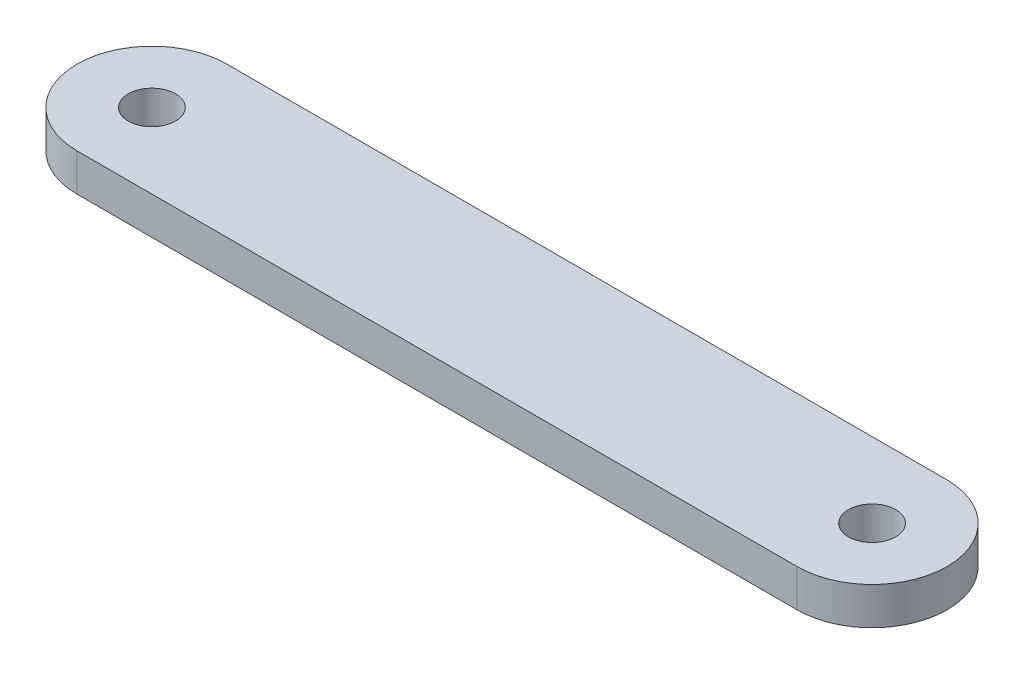
ISO-10303-21;
HEADER;
FILE_DESCRIPTION(('STEP AP214'),'2;1');
FILE_NAME('part.step','',(''),(''),'','','');
FILE_SCHEMA(('AUTOMOTIVE_DESIGN { 1 0 10303 214 1 1 1 1 }'));
ENDSEC;
DATA;
#1=APPLICATION_CONTEXT('core data for automotive mechanical design processes');
#2=APPLICATION_PROTOCOL_DEFINITION('international standard','automotive_design',2000,#1);
#3=PRODUCT_CONTEXT('',#1,'mechanical');
#4=PRODUCT('Part','Part','',(#3));
#5=PRODUCT_RELATED_PRODUCT_CATEGORY('part','',(#4));
#6=PRODUCT_DEFINITION_FORMATION('','',#4);
#7=PRODUCT_DEFINITION_CONTEXT('part definition',#1,'design');
#8=PRODUCT_DEFINITION('design','',#6,#7);
#9=PRODUCT_DEFINITION_SHAPE('','',#8);
#10=(LENGTH_UNIT() NAMED_UNIT(*) SI_UNIT(.MILLI.,.METRE.));
#11=(NAMED_UNIT(*) PLANE_ANGLE_UNIT() SI_UNIT($,.RADIAN.));
#12=(NAMED_UNIT(*) SI_UNIT($,.STERADIAN.) SOLID_ANGLE_UNIT());
#13=UNCERTAINTY_MEASURE_WITH_UNIT(LENGTH_MEASURE(1.E-05),#10,'distance_accuracy_value','');
#14=(GEOMETRIC_REPRESENTATION_CONTEXT(3) GLOBAL_UNCERTAINTY_ASSIGNED_CONTEXT((#13)) GLOBAL_UNIT_ASSIGNED_CONTEXT((#10,
#11,#12)) REPRESENTATION_CONTEXT('',''));
#15=CARTESIAN_POINT('',(0.,0.,0.));
#16=DIRECTION('',(0.,0.,1.));
#17=DIRECTION('',(1.,0.,0.));
#18=AXIS2_PLACEMENT_3D('',#15,#16,#17);
#19=CARTESIAN_POINT('',(-30.48,3.175,0.));
#20=DIRECTION('',(0.,1.,0.));
#21=DIRECTION('',(0.,0.,1.));
#22=AXIS2_PLACEMENT_3D('',#19,#20,#21);
#23=PLANE('',#22);
#24=CARTESIAN_POINT('',(-30.48,3.175,0.));
#25=DIRECTION('',(0.,1.,0.));
#26=DIRECTION('',(0.,0.,1.));
#27=AXIS2_PLACEMENT_3D('',#24,#25,#26);
#28=CIRCLE('',#27,2.000000064);
#29=CARTESIAN_POINT('',(-30.48,3.175,2.000000064));
#30=VERTEX_POINT('',#29);
#31=EDGE_CURVE('E104',#30,#30,#28,.T.);
#32=ORIENTED_EDGE('',*,*,#31,.F.);
#33=EDGE_LOOP('',(#32));
#34=FACE_BOUND('',#33,.T.);
#35=CARTESIAN_POINT('',(-30.48,3.175,0.));
#36=DIRECTION('',(0.,1.,0.));
#37=DIRECTION('',(0.,0.,1.));
#38=AXIS2_PLACEMENT_3D('',#35,#36,#37);
#39=CIRCLE('',#38,6.35);
#40=CARTESIAN_POINT('',(-30.48,3.175,-6.35));
#41=VERTEX_POINT('',#40);
#42=CARTESIAN_POINT('',(-30.48,3.175,6.35));
#43=VERTEX_POINT('',#42);
#44=EDGE_CURVE('E89',#41,#43,#39,.T.);
#45=ORIENTED_EDGE('',*,*,#44,.T.);
#46=DIRECTION('',(1.,0.,0.));
#47=VECTOR('',#46,1.);
#48=CARTESIAN_POINT('',(-30.48,3.175,6.35));
#49=LINE('',#48,#47);
#50=CARTESIAN_POINT('',(30.48,3.175,6.34999999999999));
#51=VERTEX_POINT('',#50);
#52=EDGE_CURVE('E84',#43,#51,#49,.T.);
#53=ORIENTED_EDGE('',*,*,#52,.T.);
#54=CARTESIAN_POINT('',(30.48,3.175,0.));
#55=DIRECTION('',(0.,1.,0.));
#56=DIRECTION('',(0.,0.,1.));
#57=AXIS2_PLACEMENT_3D('',#54,#55,#56);
#58=CIRCLE('',#57,6.35);
#59=CARTESIAN_POINT('',(30.48,3.175,-6.35000000000001));
#60=VERTEX_POINT('',#59);
#61=EDGE_CURVE('E87',#51,#60,#58,.T.);
#62=ORIENTED_EDGE('',*,*,#61,.T.);
#63=DIRECTION('',(-1.,0.,0.));
#64=VECTOR('',#63,1.);
#65=CARTESIAN_POINT('',(-30.48,3.175,-6.35));
#66=LINE('',#65,#64);
#67=EDGE_CURVE('E54',#60,#41,#66,.T.);
#68=ORIENTED_EDGE('',*,*,#67,.T.);
#69=EDGE_LOOP('',(#45,#53,#62,#68));
#70=FACE_BOUND('',#69,.T.);
#71=CARTESIAN_POINT('',(30.48,3.175,0.));
#72=DIRECTION('',(0.,1.,0.));
#73=DIRECTION('',(0.,0.,1.));
#74=AXIS2_PLACEMENT_3D('',#71,#72,#73);
#75=CIRCLE('',#74,2.000000064);
#76=CARTESIAN_POINT('',(30.48,3.175,2.00000006399998));
#77=VERTEX_POINT('',#76);
#78=EDGE_CURVE('E119',#77,#77,#75,.T.);
#79=ORIENTED_EDGE('',*,*,#78,.F.);
#80=EDGE_LOOP('',(#79));
#81=FACE_BOUND('',#80,.T.);
#82=ADVANCED_FACE('F37',(#34,#70,#81),#23,.T.);
#83=CARTESIAN_POINT('',(-30.48,0.,0.));
#84=DIRECTION('',(0.,1.,0.));
#85=DIRECTION('',(0.,0.,1.));
#86=AXIS2_PLACEMENT_3D('',#83,#84,#85);
#87=PLANE('',#86);
#88=CARTESIAN_POINT('',(-30.48,0.,0.));
#89=DIRECTION('',(0.,1.,0.));
#90=DIRECTION('',(0.,0.,1.));
#91=AXIS2_PLACEMENT_3D('',#88,#89,#90);
#92=CIRCLE('',#91,6.35);
#93=CARTESIAN_POINT('',(-30.48,0.,-6.35));
#94=VERTEX_POINT('',#93);
#95=CARTESIAN_POINT('',(-30.48,0.,6.35));
#96=VERTEX_POINT('',#95);
#97=EDGE_CURVE('E101',#94,#96,#92,.T.);
#98=ORIENTED_EDGE('',*,*,#97,.F.);
#99=DIRECTION('',(-1.,0.,0.));
#100=VECTOR('',#99,1.);
#101=CARTESIAN_POINT('',(-30.48,0.,-6.35));
#102=LINE('',#101,#100);
#103=CARTESIAN_POINT('',(30.48,0.,-6.35000000000001));
#104=VERTEX_POINT('',#103);
#105=EDGE_CURVE('E77',#104,#94,#102,.T.);
#106=ORIENTED_EDGE('',*,*,#105,.F.);
#107=CARTESIAN_POINT('',(30.48,0.,0.));
#108=DIRECTION('',(0.,1.,0.));
#109=DIRECTION('',(0.,0.,1.));
#110=AXIS2_PLACEMENT_3D('',#107,#108,#109);
#111=CIRCLE('',#110,6.35);
#112=CARTESIAN_POINT('',(30.48,0.,6.34999999999999));
#113=VERTEX_POINT('',#112);
#114=EDGE_CURVE('E71',#113,#104,#111,.T.);
#115=ORIENTED_EDGE('',*,*,#114,.F.);
#116=DIRECTION('',(1.,0.,0.));
#117=VECTOR('',#116,1.);
#118=CARTESIAN_POINT('',(-30.48,0.,6.35));
#119=LINE('',#118,#117);
#120=EDGE_CURVE('E93',#96,#113,#119,.T.);
#121=ORIENTED_EDGE('',*,*,#120,.F.);
#122=EDGE_LOOP('',(#98,#106,#115,#121));
#123=FACE_BOUND('',#122,.T.);
#124=CARTESIAN_POINT('',(-30.48,0.,0.));
#125=DIRECTION('',(0.,1.,0.));
#126=DIRECTION('',(0.,0.,1.));
#127=AXIS2_PLACEMENT_3D('',#124,#125,#126);
#128=CIRCLE('',#127,2.000000064);
#129=CARTESIAN_POINT('',(-30.48,0.,2.000000064));
#130=VERTEX_POINT('',#129);
#131=EDGE_CURVE('E116',#130,#130,#128,.T.);
#132=ORIENTED_EDGE('',*,*,#131,.T.);
#133=EDGE_LOOP('',(#132));
#134=FACE_BOUND('',#133,.T.);
#135=CARTESIAN_POINT('',(30.48,0.,0.));
#136=DIRECTION('',(0.,1.,0.));
#137=DIRECTION('',(0.,0.,1.));
#138=AXIS2_PLACEMENT_3D('',#135,#136,#137);
#139=CIRCLE('',#138,2.000000064);
#140=CARTESIAN_POINT('',(30.48,0.,2.00000006399998));
#141=VERTEX_POINT('',#140);
#142=EDGE_CURVE('E122',#141,#141,#139,.T.);
#143=ORIENTED_EDGE('',*,*,#142,.T.);
#144=EDGE_LOOP('',(#143));
#145=FACE_BOUND('',#144,.T.);
#146=ADVANCED_FACE('F112',(#123,#134,#145),#87,.F.);
#147=CARTESIAN_POINT('',(-30.48,3.175,0.));
#148=DIRECTION('',(0.,-1.,0.));
#149=DIRECTION('',(0.,0.,-1.));
#150=AXIS2_PLACEMENT_3D('',#147,#148,#149);
#151=CYLINDRICAL_SURFACE('',#150,6.35);
#152=ORIENTED_EDGE('',*,*,#97,.T.);
#153=DIRECTION('',(0.,-1.,0.));
#154=VECTOR('',#153,1.);
#155=CARTESIAN_POINT('',(-30.48,3.175,6.35));
#156=LINE('',#155,#154);
#157=EDGE_CURVE('E11',#43,#96,#156,.T.);
#158=ORIENTED_EDGE('',*,*,#157,.F.);
#159=ORIENTED_EDGE('',*,*,#44,.F.);
#160=DIRECTION('',(0.,-1.,0.));
#161=VECTOR('',#160,1.);
#162=CARTESIAN_POINT('',(-30.48,3.175,-6.35));
#163=LINE('',#162,#161);
#164=EDGE_CURVE('E97',#41,#94,#163,.T.);
#165=ORIENTED_EDGE('',*,*,#164,.T.);
#166=EDGE_LOOP('',(#152,#158,#159,#165));
#167=FACE_BOUND('',#166,.T.);
#168=ADVANCED_FACE('F39',(#167),#151,.T.);
#169=CARTESIAN_POINT('',(-30.48,3.175,6.35));
#170=DIRECTION('',(0.,0.,-1.));
#171=DIRECTION('',(-1.,0.,0.));
#172=AXIS2_PLACEMENT_3D('',#169,#170,#171);
#173=PLANE('',#172);
#174=ORIENTED_EDGE('',*,*,#120,.T.);
#175=DIRECTION('',(0.,-1.,0.));
#176=VECTOR('',#175,1.);
#177=CARTESIAN_POINT('',(30.48,3.175,6.34999999999999));
#178=LINE('',#177,#176);
#179=EDGE_CURVE('E46',#51,#113,#178,.T.);
#180=ORIENTED_EDGE('',*,*,#179,.F.);
#181=ORIENTED_EDGE('',*,*,#52,.F.);
#182=ORIENTED_EDGE('',*,*,#157,.T.);
#183=EDGE_LOOP('',(#174,#180,#181,#182));
#184=FACE_BOUND('',#183,.T.);
#185=ADVANCED_FACE('F92',(#184),#173,.F.);
#186=CARTESIAN_POINT('',(30.48,3.175,0.));
#187=DIRECTION('',(0.,-1.,0.));
#188=DIRECTION('',(0.,0.,-1.));
#189=AXIS2_PLACEMENT_3D('',#186,#187,#188);
#190=CYLINDRICAL_SURFACE('',#189,6.35);
#191=ORIENTED_EDGE('',*,*,#114,.T.);
#192=DIRECTION('',(0.,-1.,0.));
#193=VECTOR('',#192,1.);
#194=CARTESIAN_POINT('',(30.48,3.175,-6.35000000000001));
#195=LINE('',#194,#193);
#196=EDGE_CURVE('E94',#60,#104,#195,.T.);
#197=ORIENTED_EDGE('',*,*,#196,.F.);
#198=ORIENTED_EDGE('',*,*,#61,.F.);
#199=ORIENTED_EDGE('',*,*,#179,.T.);
#200=EDGE_LOOP('',(#191,#197,#198,#199));
#201=FACE_BOUND('',#200,.T.);
#202=ADVANCED_FACE('F95',(#201),#190,.T.);
#203=CARTESIAN_POINT('',(-30.48,3.175,-6.35));
#204=DIRECTION('',(0.,0.,1.));
#205=DIRECTION('',(1.,0.,0.));
#206=AXIS2_PLACEMENT_3D('',#203,#204,#205);
#207=PLANE('',#206);
#208=ORIENTED_EDGE('',*,*,#105,.T.);
#209=ORIENTED_EDGE('',*,*,#164,.F.);
#210=ORIENTED_EDGE('',*,*,#67,.F.);
#211=ORIENTED_EDGE('',*,*,#196,.T.);
#212=EDGE_LOOP('',(#208,#209,#210,#211));
#213=FACE_BOUND('',#212,.T.);
#214=ADVANCED_FACE('F109',(#213),#207,.F.);
#215=CARTESIAN_POINT('',(-30.48,3.175,0.));
#216=DIRECTION('',(0.,-1.,0.));
#217=DIRECTION('',(0.,0.,-1.));
#218=AXIS2_PLACEMENT_3D('',#215,#216,#217);
#219=CYLINDRICAL_SURFACE('',#218,2.000000064);
#220=ORIENTED_EDGE('',*,*,#31,.T.);
#221=EDGE_LOOP('',(#220));
#222=FACE_BOUND('',#221,.T.);
#223=ORIENTED_EDGE('',*,*,#131,.F.);
#224=EDGE_LOOP('',(#223));
#225=FACE_BOUND('',#224,.T.);
#226=ADVANCED_FACE('F139',(#222,#225),#219,.F.);
#227=CARTESIAN_POINT('',(30.48,3.175,0.));
#228=DIRECTION('',(0.,-1.,0.));
#229=DIRECTION('',(0.,0.,-1.));
#230=AXIS2_PLACEMENT_3D('',#227,#228,#229);
#231=CYLINDRICAL_SURFACE('',#230,2.000000064);
#232=ORIENTED_EDGE('',*,*,#78,.T.);
#233=EDGE_LOOP('',(#232));
#234=FACE_BOUND('',#233,.T.);
#235=ORIENTED_EDGE('',*,*,#142,.F.);
#236=EDGE_LOOP('',(#235));
#237=FACE_BOUND('',#236,.T.);
#238=ADVANCED_FACE('F128',(#234,#237),#231,.F.);
#239=CLOSED_SHELL('',(#82,#146,#168,#185,#202,#214,#226,#238));
#240=MANIFOLD_SOLID_BREP('B2',#239);
#241=ADVANCED_BREP_SHAPE_REPRESENTATION('',(#18,#240),#14);
#242=SHAPE_DEFINITION_REPRESENTATION(#9,#241);
ENDSEC;
END-ISO-10303-21;
